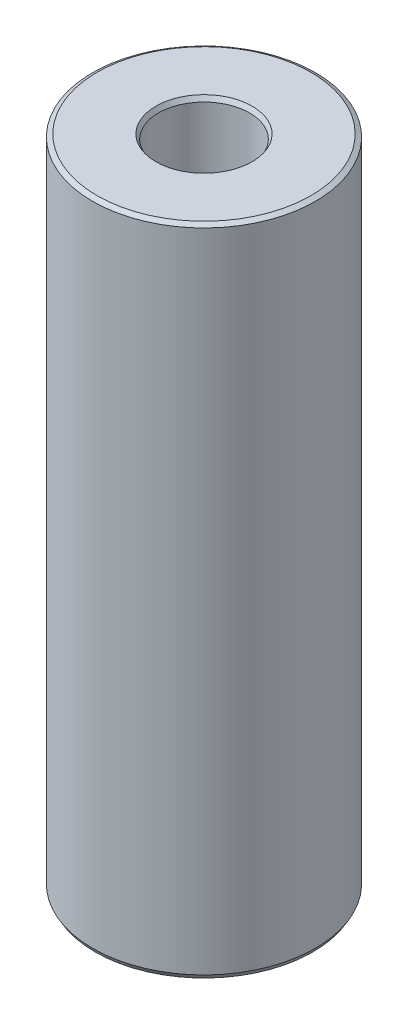
ISO-10303-21;
HEADER;
FILE_DESCRIPTION(('STEP AP214'),'2;1');
FILE_NAME('part.step','',(''),(''),'','','');
FILE_SCHEMA(('AUTOMOTIVE_DESIGN { 1 0 10303 214 1 1 1 1 }'));
ENDSEC;
DATA;
#1=APPLICATION_CONTEXT('core data for automotive mechanical design processes');
#2=APPLICATION_PROTOCOL_DEFINITION('international standard','automotive_design',2000,#1);
#3=PRODUCT_CONTEXT('',#1,'mechanical');
#4=PRODUCT('Part','Part','',(#3));
#5=PRODUCT_RELATED_PRODUCT_CATEGORY('part','',(#4));
#6=PRODUCT_DEFINITION_FORMATION('','',#4);
#7=PRODUCT_DEFINITION_CONTEXT('part definition',#1,'design');
#8=PRODUCT_DEFINITION('design','',#6,#7);
#9=PRODUCT_DEFINITION_SHAPE('','',#8);
#10=(LENGTH_UNIT() NAMED_UNIT(*) SI_UNIT(.MILLI.,.METRE.));
#11=(NAMED_UNIT(*) PLANE_ANGLE_UNIT() SI_UNIT($,.RADIAN.));
#12=(NAMED_UNIT(*) SI_UNIT($,.STERADIAN.) SOLID_ANGLE_UNIT());
#13=UNCERTAINTY_MEASURE_WITH_UNIT(LENGTH_MEASURE(1.E-05),#10,'distance_accuracy_value','');
#14=(GEOMETRIC_REPRESENTATION_CONTEXT(3) GLOBAL_UNCERTAINTY_ASSIGNED_CONTEXT((#13)) GLOBAL_UNIT_ASSIGNED_CONTEXT((#10,
#11,#12)) REPRESENTATION_CONTEXT('',''));
#15=CARTESIAN_POINT('',(0.,0.,0.));
#16=DIRECTION('',(0.,0.,1.));
#17=DIRECTION('',(1.,0.,0.));
#18=AXIS2_PLACEMENT_3D('',#15,#16,#17);
#19=CARTESIAN_POINT('',(0.,278.738901771201,0.));
#20=DIRECTION('',(0.,-1.,0.));
#21=DIRECTION('',(0.,0.,-1.));
#22=AXIS2_PLACEMENT_3D('',#19,#20,#21);
#23=CYLINDRICAL_SURFACE('',#22,47.5);
#24=CARTESIAN_POINT('',(0.,1.93325626379892,0.));
#25=DIRECTION('',(0.,1.,0.));
#26=DIRECTION('',(0.,0.,1.));
#27=AXIS2_PLACEMENT_3D('',#24,#25,#26);
#28=CIRCLE('',#27,47.5);
#29=CARTESIAN_POINT('',(0.,1.93325626379892,47.5));
#30=VERTEX_POINT('',#29);
#31=EDGE_CURVE('E10',#30,#30,#28,.T.);
#32=ORIENTED_EDGE('',*,*,#31,.T.);
#33=EDGE_LOOP('',(#32));
#34=FACE_BOUND('',#33,.T.);
#35=CARTESIAN_POINT('',(0.,277.622735746884,0.));
#36=DIRECTION('',(0.,1.,0.));
#37=DIRECTION('',(0.,0.,1.));
#38=AXIS2_PLACEMENT_3D('',#35,#36,#37);
#39=CIRCLE('',#38,47.5);
#40=CARTESIAN_POINT('',(0.,277.622735746884,47.5));
#41=VERTEX_POINT('',#40);
#42=EDGE_CURVE('E50',#41,#41,#39,.F.);
#43=ORIENTED_EDGE('',*,*,#42,.T.);
#44=EDGE_LOOP('',(#43));
#45=FACE_BOUND('',#44,.T.);
#46=ADVANCED_FACE('F39',(#34,#45),#23,.T.);
#47=CARTESIAN_POINT('',(0.,278.738901771201,0.));
#48=DIRECTION('',(0.,1.,0.));
#49=DIRECTION('',(0.,0.,1.));
#50=AXIS2_PLACEMENT_3D('',#47,#48,#49);
#51=PLANE('',#50);
#52=CARTESIAN_POINT('',(0.,278.738901771201,0.));
#53=DIRECTION('',(0.,1.,0.));
#54=DIRECTION('',(0.,0.,1.));
#55=AXIS2_PLACEMENT_3D('',#52,#53,#54);
#56=CIRCLE('',#55,20.5256326295896);
#57=CARTESIAN_POINT('',(0.,278.738901771201,20.5256326295896));
#58=VERTEX_POINT('',#57);
#59=EDGE_CURVE('E58',#58,#58,#56,.F.);
#60=ORIENTED_EDGE('',*,*,#59,.T.);
#61=EDGE_LOOP('',(#60));
#62=FACE_BOUND('',#61,.T.);
#63=CARTESIAN_POINT('',(0.,278.738901771201,0.));
#64=DIRECTION('',(0.,1.,0.));
#65=DIRECTION('',(0.,0.,1.));
#66=AXIS2_PLACEMENT_3D('',#63,#64,#65);
#67=CIRCLE('',#66,45.5667437362009);
#68=CARTESIAN_POINT('',(0.,278.738901771201,45.5667437362009));
#69=VERTEX_POINT('',#68);
#70=EDGE_CURVE('E61',#69,#69,#67,.T.);
#71=ORIENTED_EDGE('',*,*,#70,.T.);
#72=EDGE_LOOP('',(#71));
#73=FACE_BOUND('',#72,.T.);
#74=ADVANCED_FACE('F88',(#62,#73),#51,.T.);
#75=CARTESIAN_POINT('',(0.,0.,0.));
#76=DIRECTION('',(0.,1.,0.));
#77=DIRECTION('',(0.,0.,1.));
#78=AXIS2_PLACEMENT_3D('',#75,#76,#77);
#79=PLANE('',#78);
#80=CARTESIAN_POINT('',(0.,0.,0.));
#81=DIRECTION('',(0.,1.,0.));
#82=DIRECTION('',(0.,0.,1.));
#83=AXIS2_PLACEMENT_3D('',#80,#81,#82);
#84=CIRCLE('',#83,21.3427228690717);
#85=CARTESIAN_POINT('',(0.,0.,21.3427228690717));
#86=VERTEX_POINT('',#85);
#87=EDGE_CURVE('E51',#86,#86,#84,.T.);
#88=ORIENTED_EDGE('',*,*,#87,.T.);
#89=EDGE_LOOP('',(#88));
#90=FACE_BOUND('',#89,.T.);
#91=CARTESIAN_POINT('',(0.,0.,0.));
#92=DIRECTION('',(0.,1.,0.));
#93=DIRECTION('',(0.,0.,1.));
#94=AXIS2_PLACEMENT_3D('',#91,#92,#93);
#95=CIRCLE('',#94,46.3838339756832);
#96=CARTESIAN_POINT('',(0.,0.,46.3838339756832));
#97=VERTEX_POINT('',#96);
#98=EDGE_CURVE('E54',#97,#97,#95,.F.);
#99=ORIENTED_EDGE('',*,*,#98,.T.);
#100=EDGE_LOOP('',(#99));
#101=FACE_BOUND('',#100,.T.);
#102=ADVANCED_FACE('F83',(#90,#101),#79,.F.);
#103=CARTESIAN_POINT('',(0.,278.738901771201,0.));
#104=DIRECTION('',(0.,-1.,0.));
#105=DIRECTION('',(0.,0.,-1.));
#106=AXIS2_PLACEMENT_3D('',#103,#104,#105);
#107=CYLINDRICAL_SURFACE('',#106,19.4094666052727);
#108=CARTESIAN_POINT('',(0.,276.805645507402,0.));
#109=DIRECTION('',(0.,1.,0.));
#110=DIRECTION('',(0.,0.,1.));
#111=AXIS2_PLACEMENT_3D('',#108,#109,#110);
#112=CIRCLE('',#111,19.4094666052727);
#113=CARTESIAN_POINT('',(0.,276.805645507402,19.4094666052727));
#114=VERTEX_POINT('',#113);
#115=EDGE_CURVE('E67',#114,#114,#112,.T.);
#116=ORIENTED_EDGE('',*,*,#115,.T.);
#117=EDGE_LOOP('',(#116));
#118=FACE_BOUND('',#117,.T.);
#119=CARTESIAN_POINT('',(0.,1.11616602431691,0.));
#120=DIRECTION('',(0.,1.,0.));
#121=DIRECTION('',(0.,0.,1.));
#122=AXIS2_PLACEMENT_3D('',#119,#120,#121);
#123=CIRCLE('',#122,19.4094666052727);
#124=CARTESIAN_POINT('',(0.,1.11616602431691,19.4094666052727));
#125=VERTEX_POINT('',#124);
#126=EDGE_CURVE('E69',#125,#125,#123,.F.);
#127=ORIENTED_EDGE('',*,*,#126,.T.);
#128=EDGE_LOOP('',(#127));
#129=FACE_BOUND('',#128,.T.);
#130=ADVANCED_FACE('F71',(#118,#129),#107,.F.);
#131=CARTESIAN_POINT('',(0.,276.805645507402,0.));
#132=DIRECTION('',(0.,1.,0.));
#133=DIRECTION('',(0.,0.,1.));
#134=AXIS2_PLACEMENT_3D('',#131,#132,#133);
#135=CONICAL_SURFACE('',#134,19.4094666052727,0.5235987755983);
#136=ORIENTED_EDGE('',*,*,#59,.F.);
#137=EDGE_LOOP('',(#136));
#138=FACE_BOUND('',#137,.T.);
#139=ORIENTED_EDGE('',*,*,#115,.F.);
#140=EDGE_LOOP('',(#139));
#141=FACE_BOUND('',#140,.T.);
#142=ADVANCED_FACE('F77',(#138,#141),#135,.F.);
#143=CARTESIAN_POINT('',(0.,0.,0.));
#144=DIRECTION('',(0.,-1.,0.));
#145=DIRECTION('',(0.,0.,-1.));
#146=AXIS2_PLACEMENT_3D('',#143,#144,#145);
#147=CONICAL_SURFACE('',#146,21.3427228690717,1.0471975511966);
#148=ORIENTED_EDGE('',*,*,#126,.F.);
#149=EDGE_LOOP('',(#148));
#150=FACE_BOUND('',#149,.T.);
#151=ORIENTED_EDGE('',*,*,#87,.F.);
#152=EDGE_LOOP('',(#151));
#153=FACE_BOUND('',#152,.T.);
#154=ADVANCED_FACE('F73',(#150,#153),#147,.F.);
#155=CARTESIAN_POINT('',(0.,1.93325626379892,0.));
#156=DIRECTION('',(0.,1.,0.));
#157=DIRECTION('',(0.,0.,1.));
#158=AXIS2_PLACEMENT_3D('',#155,#156,#157);
#159=CONICAL_SURFACE('',#158,47.5,0.523598775598303);
#160=ORIENTED_EDGE('',*,*,#98,.F.);
#161=EDGE_LOOP('',(#160));
#162=FACE_BOUND('',#161,.T.);
#163=ORIENTED_EDGE('',*,*,#31,.F.);
#164=EDGE_LOOP('',(#163));
#165=FACE_BOUND('',#164,.T.);
#166=ADVANCED_FACE('F76',(#162,#165),#159,.T.);
#167=CARTESIAN_POINT('',(0.,278.738901771201,0.));
#168=DIRECTION('',(0.,-1.,0.));
#169=DIRECTION('',(0.,0.,-1.));
#170=AXIS2_PLACEMENT_3D('',#167,#168,#169);
#171=CONICAL_SURFACE('',#170,45.5667437362009,1.04719755119659);
#172=ORIENTED_EDGE('',*,*,#42,.F.);
#173=EDGE_LOOP('',(#172));
#174=FACE_BOUND('',#173,.T.);
#175=ORIENTED_EDGE('',*,*,#70,.F.);
#176=EDGE_LOOP('',(#175));
#177=FACE_BOUND('',#176,.T.);
#178=ADVANCED_FACE('F45',(#174,#177),#171,.T.);
#179=CLOSED_SHELL('',(#46,#74,#102,#130,#142,#154,#166,#178));
#180=MANIFOLD_SOLID_BREP('B2',#179);
#181=ADVANCED_BREP_SHAPE_REPRESENTATION('',(#18,#180),#14);
#182=SHAPE_DEFINITION_REPRESENTATION(#9,#181);
ENDSEC;
END-ISO-10303-21;
